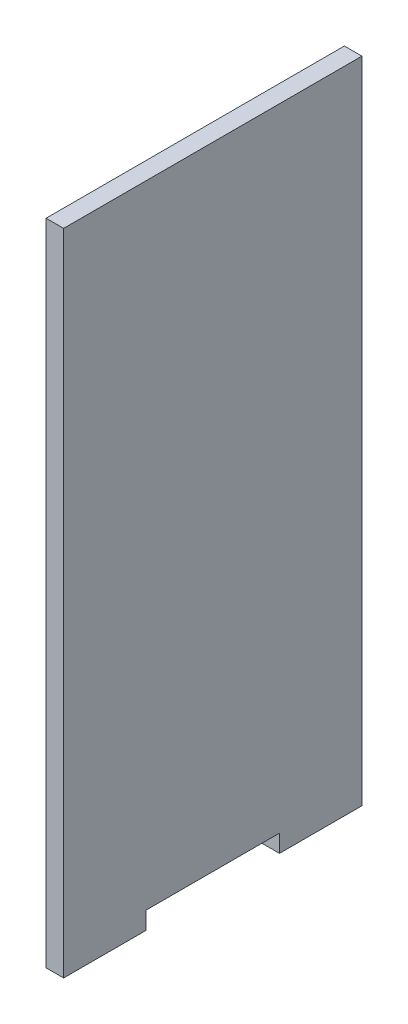
ISO-10303-21;
HEADER;
FILE_DESCRIPTION(('STEP AP214'),'2;1');
FILE_NAME('part.step','',(''),(''),'','','');
FILE_SCHEMA(('AUTOMOTIVE_DESIGN { 1 0 10303 214 1 1 1 1 }'));
ENDSEC;
DATA;
#1=APPLICATION_CONTEXT('core data for automotive mechanical design processes');
#2=APPLICATION_PROTOCOL_DEFINITION('international standard','automotive_design',2000,#1);
#3=PRODUCT_CONTEXT('',#1,'mechanical');
#4=PRODUCT('Part','Part','',(#3));
#5=PRODUCT_RELATED_PRODUCT_CATEGORY('part','',(#4));
#6=PRODUCT_DEFINITION_FORMATION('','',#4);
#7=PRODUCT_DEFINITION_CONTEXT('part definition',#1,'design');
#8=PRODUCT_DEFINITION('design','',#6,#7);
#9=PRODUCT_DEFINITION_SHAPE('','',#8);
#10=(LENGTH_UNIT() NAMED_UNIT(*) SI_UNIT(.MILLI.,.METRE.));
#11=(NAMED_UNIT(*) PLANE_ANGLE_UNIT() SI_UNIT($,.RADIAN.));
#12=(NAMED_UNIT(*) SI_UNIT($,.STERADIAN.) SOLID_ANGLE_UNIT());
#13=UNCERTAINTY_MEASURE_WITH_UNIT(LENGTH_MEASURE(1.E-05),#10,'distance_accuracy_value','');
#14=(GEOMETRIC_REPRESENTATION_CONTEXT(3) GLOBAL_UNCERTAINTY_ASSIGNED_CONTEXT((#13)) GLOBAL_UNIT_ASSIGNED_CONTEXT((#10,
#11,#12)) REPRESENTATION_CONTEXT('',''));
#15=CARTESIAN_POINT('',(0.,0.,0.));
#16=DIRECTION('',(0.,0.,1.));
#17=DIRECTION('',(1.,0.,0.));
#18=AXIS2_PLACEMENT_3D('',#15,#16,#17);
#19=CARTESIAN_POINT('',(5.,0.,42.5));
#20=DIRECTION('',(0.,0.,-1.));
#21=DIRECTION('',(-1.,0.,0.));
#22=AXIS2_PLACEMENT_3D('',#19,#20,#21);
#23=PLANE('',#22);
#24=DIRECTION('',(0.,-1.,0.));
#25=VECTOR('',#24,1.);
#26=CARTESIAN_POINT('',(0.,0.,42.5));
#27=LINE('',#26,#25);
#28=CARTESIAN_POINT('',(0.,180.,42.5));
#29=VERTEX_POINT('',#28);
#30=CARTESIAN_POINT('',(0.,-5.,42.5));
#31=VERTEX_POINT('',#30);
#32=EDGE_CURVE('E84',#29,#31,#27,.T.);
#33=ORIENTED_EDGE('',*,*,#32,.T.);
#34=DIRECTION('',(-1.,0.,0.));
#35=VECTOR('',#34,1.);
#36=CARTESIAN_POINT('',(5.,-5.,42.5));
#37=LINE('',#36,#35);
#38=CARTESIAN_POINT('',(5.,-5.,42.5));
#39=VERTEX_POINT('',#38);
#40=EDGE_CURVE('E11',#39,#31,#37,.T.);
#41=ORIENTED_EDGE('',*,*,#40,.F.);
#42=DIRECTION('',(0.,-1.,0.));
#43=VECTOR('',#42,1.);
#44=CARTESIAN_POINT('',(5.,180.,42.5));
#45=LINE('',#44,#43);
#46=CARTESIAN_POINT('',(5.,180.,42.5));
#47=VERTEX_POINT('',#46);
#48=EDGE_CURVE('E90',#47,#39,#45,.T.);
#49=ORIENTED_EDGE('',*,*,#48,.F.);
#50=DIRECTION('',(-1.,0.,0.));
#51=VECTOR('',#50,1.);
#52=CARTESIAN_POINT('',(5.,180.,42.5));
#53=LINE('',#52,#51);
#54=EDGE_CURVE('E125',#47,#29,#53,.T.);
#55=ORIENTED_EDGE('',*,*,#54,.T.);
#56=EDGE_LOOP('',(#33,#41,#49,#55));
#57=FACE_BOUND('',#56,.T.);
#58=ADVANCED_FACE('F33',(#57),#23,.F.);
#59=CARTESIAN_POINT('',(5.,-5.,42.5));
#60=DIRECTION('',(0.,1.,0.));
#61=DIRECTION('',(0.,0.,1.));
#62=AXIS2_PLACEMENT_3D('',#59,#60,#61);
#63=PLANE('',#62);
#64=DIRECTION('',(0.,0.,-1.));
#65=VECTOR('',#64,1.);
#66=CARTESIAN_POINT('',(0.,-5.,42.5));
#67=LINE('',#66,#65);
#68=CARTESIAN_POINT('',(0.,-5.,19.));
#69=VERTEX_POINT('',#68);
#70=EDGE_CURVE('E130',#31,#69,#67,.T.);
#71=ORIENTED_EDGE('',*,*,#70,.T.);
#72=DIRECTION('',(-1.,0.,0.));
#73=VECTOR('',#72,1.);
#74=CARTESIAN_POINT('',(5.,-5.,19.));
#75=LINE('',#74,#73);
#76=CARTESIAN_POINT('',(5.,-5.,19.));
#77=VERTEX_POINT('',#76);
#78=EDGE_CURVE('E41',#77,#69,#75,.T.);
#79=ORIENTED_EDGE('',*,*,#78,.F.);
#80=DIRECTION('',(0.,0.,-1.));
#81=VECTOR('',#80,1.);
#82=CARTESIAN_POINT('',(5.,-5.,42.5));
#83=LINE('',#82,#81);
#84=EDGE_CURVE('E174',#39,#77,#83,.T.);
#85=ORIENTED_EDGE('',*,*,#84,.F.);
#86=ORIENTED_EDGE('',*,*,#40,.T.);
#87=EDGE_LOOP('',(#71,#79,#85,#86));
#88=FACE_BOUND('',#87,.T.);
#89=ADVANCED_FACE('F176',(#88),#63,.F.);
#90=CARTESIAN_POINT('',(5.,-5.,19.));
#91=DIRECTION('',(0.,0.,1.));
#92=DIRECTION('',(1.,0.,0.));
#93=AXIS2_PLACEMENT_3D('',#90,#91,#92);
#94=PLANE('',#93);
#95=DIRECTION('',(0.,1.,0.));
#96=VECTOR('',#95,1.);
#97=CARTESIAN_POINT('',(0.,-5.,19.));
#98=LINE('',#97,#96);
#99=CARTESIAN_POINT('',(0.,0.,19.));
#100=VERTEX_POINT('',#99);
#101=EDGE_CURVE('E132',#69,#100,#98,.T.);
#102=ORIENTED_EDGE('',*,*,#101,.T.);
#103=DIRECTION('',(-1.,0.,0.));
#104=VECTOR('',#103,1.);
#105=CARTESIAN_POINT('',(5.,0.,19.));
#106=LINE('',#105,#104);
#107=CARTESIAN_POINT('',(5.,0.,19.));
#108=VERTEX_POINT('',#107);
#109=EDGE_CURVE('E149',#108,#100,#106,.T.);
#110=ORIENTED_EDGE('',*,*,#109,.F.);
#111=DIRECTION('',(0.,1.,0.));
#112=VECTOR('',#111,1.);
#113=CARTESIAN_POINT('',(5.,-5.,19.));
#114=LINE('',#113,#112);
#115=EDGE_CURVE('E158',#77,#108,#114,.T.);
#116=ORIENTED_EDGE('',*,*,#115,.F.);
#117=ORIENTED_EDGE('',*,*,#78,.T.);
#118=EDGE_LOOP('',(#102,#110,#116,#117));
#119=FACE_BOUND('',#118,.T.);
#120=ADVANCED_FACE('F156',(#119),#94,.F.);
#121=CARTESIAN_POINT('',(5.,0.,19.));
#122=DIRECTION('',(0.,1.,0.));
#123=DIRECTION('',(0.,0.,1.));
#124=AXIS2_PLACEMENT_3D('',#121,#122,#123);
#125=PLANE('',#124);
#126=DIRECTION('',(0.,0.,-1.));
#127=VECTOR('',#126,1.);
#128=CARTESIAN_POINT('',(0.,0.,19.));
#129=LINE('',#128,#127);
#130=CARTESIAN_POINT('',(0.,0.,-19.));
#131=VERTEX_POINT('',#130);
#132=EDGE_CURVE('E134',#100,#131,#129,.T.);
#133=ORIENTED_EDGE('',*,*,#132,.T.);
#134=DIRECTION('',(-1.,0.,0.));
#135=VECTOR('',#134,1.);
#136=CARTESIAN_POINT('',(5.,0.,-19.));
#137=LINE('',#136,#135);
#138=CARTESIAN_POINT('',(5.,0.,-19.));
#139=VERTEX_POINT('',#138);
#140=EDGE_CURVE('E146',#139,#131,#137,.T.);
#141=ORIENTED_EDGE('',*,*,#140,.F.);
#142=DIRECTION('',(0.,0.,-1.));
#143=VECTOR('',#142,1.);
#144=CARTESIAN_POINT('',(5.,0.,19.));
#145=LINE('',#144,#143);
#146=EDGE_CURVE('E170',#108,#139,#145,.T.);
#147=ORIENTED_EDGE('',*,*,#146,.F.);
#148=ORIENTED_EDGE('',*,*,#109,.T.);
#149=EDGE_LOOP('',(#133,#141,#147,#148));
#150=FACE_BOUND('',#149,.T.);
#151=ADVANCED_FACE('F166',(#150),#125,.F.);
#152=CARTESIAN_POINT('',(5.,-5.,-19.));
#153=DIRECTION('',(0.,0.,-1.));
#154=DIRECTION('',(-1.,0.,0.));
#155=AXIS2_PLACEMENT_3D('',#152,#153,#154);
#156=PLANE('',#155);
#157=DIRECTION('',(0.,-1.,0.));
#158=VECTOR('',#157,1.);
#159=CARTESIAN_POINT('',(0.,-5.,-19.));
#160=LINE('',#159,#158);
#161=CARTESIAN_POINT('',(0.,-5.,-19.));
#162=VERTEX_POINT('',#161);
#163=EDGE_CURVE('E136',#131,#162,#160,.T.);
#164=ORIENTED_EDGE('',*,*,#163,.T.);
#165=DIRECTION('',(-1.,0.,0.));
#166=VECTOR('',#165,1.);
#167=CARTESIAN_POINT('',(5.,-5.,-19.));
#168=LINE('',#167,#166);
#169=CARTESIAN_POINT('',(5.,-5.,-19.));
#170=VERTEX_POINT('',#169);
#171=EDGE_CURVE('E120',#170,#162,#168,.T.);
#172=ORIENTED_EDGE('',*,*,#171,.F.);
#173=DIRECTION('',(0.,-1.,0.));
#174=VECTOR('',#173,1.);
#175=CARTESIAN_POINT('',(5.,-5.,-19.));
#176=LINE('',#175,#174);
#177=EDGE_CURVE('E110',#139,#170,#176,.T.);
#178=ORIENTED_EDGE('',*,*,#177,.F.);
#179=ORIENTED_EDGE('',*,*,#140,.T.);
#180=EDGE_LOOP('',(#164,#172,#178,#179));
#181=FACE_BOUND('',#180,.T.);
#182=ADVANCED_FACE('F169',(#181),#156,.F.);
#183=CARTESIAN_POINT('',(5.,-5.,-42.5));
#184=DIRECTION('',(0.,1.,0.));
#185=DIRECTION('',(0.,0.,1.));
#186=AXIS2_PLACEMENT_3D('',#183,#184,#185);
#187=PLANE('',#186);
#188=DIRECTION('',(0.,0.,-1.));
#189=VECTOR('',#188,1.);
#190=CARTESIAN_POINT('',(0.,-5.,-42.5));
#191=LINE('',#190,#189);
#192=CARTESIAN_POINT('',(0.,-5.,-42.5));
#193=VERTEX_POINT('',#192);
#194=EDGE_CURVE('E119',#162,#193,#191,.T.);
#195=ORIENTED_EDGE('',*,*,#194,.T.);
#196=DIRECTION('',(-1.,0.,0.));
#197=VECTOR('',#196,1.);
#198=CARTESIAN_POINT('',(5.,-5.,-42.5));
#199=LINE('',#198,#197);
#200=CARTESIAN_POINT('',(5.,-5.,-42.5));
#201=VERTEX_POINT('',#200);
#202=EDGE_CURVE('E116',#201,#193,#199,.T.);
#203=ORIENTED_EDGE('',*,*,#202,.F.);
#204=DIRECTION('',(0.,0.,-1.));
#205=VECTOR('',#204,1.);
#206=CARTESIAN_POINT('',(5.,-5.,-42.5));
#207=LINE('',#206,#205);
#208=EDGE_CURVE('E104',#170,#201,#207,.T.);
#209=ORIENTED_EDGE('',*,*,#208,.F.);
#210=ORIENTED_EDGE('',*,*,#171,.T.);
#211=EDGE_LOOP('',(#195,#203,#209,#210));
#212=FACE_BOUND('',#211,.T.);
#213=ADVANCED_FACE('F117',(#212),#187,.F.);
#214=CARTESIAN_POINT('',(5.,180.,-42.5));
#215=DIRECTION('',(0.,0.,1.));
#216=DIRECTION('',(0.,-1.,0.));
#217=AXIS2_PLACEMENT_3D('',#214,#215,#216);
#218=PLANE('',#217);
#219=DIRECTION('',(0.,1.,0.));
#220=VECTOR('',#219,1.);
#221=CARTESIAN_POINT('',(0.,180.,-42.5));
#222=LINE('',#221,#220);
#223=CARTESIAN_POINT('',(0.,180.,-42.5));
#224=VERTEX_POINT('',#223);
#225=EDGE_CURVE('E77',#193,#224,#222,.T.);
#226=ORIENTED_EDGE('',*,*,#225,.T.);
#227=DIRECTION('',(-1.,0.,0.));
#228=VECTOR('',#227,1.);
#229=CARTESIAN_POINT('',(5.,180.,-42.5));
#230=LINE('',#229,#228);
#231=CARTESIAN_POINT('',(5.,180.,-42.5));
#232=VERTEX_POINT('',#231);
#233=EDGE_CURVE('E121',#232,#224,#230,.T.);
#234=ORIENTED_EDGE('',*,*,#233,.F.);
#235=DIRECTION('',(0.,1.,0.));
#236=VECTOR('',#235,1.);
#237=CARTESIAN_POINT('',(5.,0.,-42.5));
#238=LINE('',#237,#236);
#239=EDGE_CURVE('E108',#201,#232,#238,.T.);
#240=ORIENTED_EDGE('',*,*,#239,.F.);
#241=ORIENTED_EDGE('',*,*,#202,.T.);
#242=EDGE_LOOP('',(#226,#234,#240,#241));
#243=FACE_BOUND('',#242,.T.);
#244=ADVANCED_FACE('F123',(#243),#218,.F.);
#245=CARTESIAN_POINT('',(5.,180.,42.5));
#246=DIRECTION('',(0.,-1.,0.));
#247=DIRECTION('',(0.,0.,-1.));
#248=AXIS2_PLACEMENT_3D('',#245,#246,#247);
#249=PLANE('',#248);
#250=DIRECTION('',(0.,0.,1.));
#251=VECTOR('',#250,1.);
#252=CARTESIAN_POINT('',(0.,180.,42.5));
#253=LINE('',#252,#251);
#254=EDGE_CURVE('E140',#224,#29,#253,.T.);
#255=ORIENTED_EDGE('',*,*,#254,.T.);
#256=ORIENTED_EDGE('',*,*,#54,.F.);
#257=DIRECTION('',(0.,0.,1.));
#258=VECTOR('',#257,1.);
#259=CARTESIAN_POINT('',(5.,180.,42.5));
#260=LINE('',#259,#258);
#261=EDGE_CURVE('E49',#232,#47,#260,.T.);
#262=ORIENTED_EDGE('',*,*,#261,.F.);
#263=ORIENTED_EDGE('',*,*,#233,.T.);
#264=EDGE_LOOP('',(#255,#256,#262,#263));
#265=FACE_BOUND('',#264,.T.);
#266=ADVANCED_FACE('F179',(#265),#249,.F.);
#267=CARTESIAN_POINT('',(5.,0.,0.));
#268=DIRECTION('',(1.,0.,0.));
#269=DIRECTION('',(0.,0.,-1.));
#270=AXIS2_PLACEMENT_3D('',#267,#268,#269);
#271=PLANE('',#270);
#272=ORIENTED_EDGE('',*,*,#48,.T.);
#273=ORIENTED_EDGE('',*,*,#84,.T.);
#274=ORIENTED_EDGE('',*,*,#115,.T.);
#275=ORIENTED_EDGE('',*,*,#146,.T.);
#276=ORIENTED_EDGE('',*,*,#177,.T.);
#277=ORIENTED_EDGE('',*,*,#208,.T.);
#278=ORIENTED_EDGE('',*,*,#239,.T.);
#279=ORIENTED_EDGE('',*,*,#261,.T.);
#280=EDGE_LOOP('',(#272,#273,#274,#275,#276,#277,#278,#279));
#281=FACE_BOUND('',#280,.T.);
#282=ADVANCED_FACE('F106',(#281),#271,.T.);
#283=CARTESIAN_POINT('',(0.,0.,0.));
#284=DIRECTION('',(1.,0.,0.));
#285=DIRECTION('',(0.,0.,-1.));
#286=AXIS2_PLACEMENT_3D('',#283,#284,#285);
#287=PLANE('',#286);
#288=ORIENTED_EDGE('',*,*,#32,.F.);
#289=ORIENTED_EDGE('',*,*,#254,.F.);
#290=ORIENTED_EDGE('',*,*,#225,.F.);
#291=ORIENTED_EDGE('',*,*,#194,.F.);
#292=ORIENTED_EDGE('',*,*,#163,.F.);
#293=ORIENTED_EDGE('',*,*,#132,.F.);
#294=ORIENTED_EDGE('',*,*,#101,.F.);
#295=ORIENTED_EDGE('',*,*,#70,.F.);
#296=EDGE_LOOP('',(#288,#289,#290,#291,#292,#293,#294,#295));
#297=FACE_BOUND('',#296,.T.);
#298=ADVANCED_FACE('F162',(#297),#287,.F.);
#299=CLOSED_SHELL('',(#58,#89,#120,#151,#182,#213,#244,#266,#282,#298));
#300=MANIFOLD_SOLID_BREP('B2',#299);
#301=ADVANCED_BREP_SHAPE_REPRESENTATION('',(#18,#300),#14);
#302=SHAPE_DEFINITION_REPRESENTATION(#9,#301);
ENDSEC;
END-ISO-10303-21;
